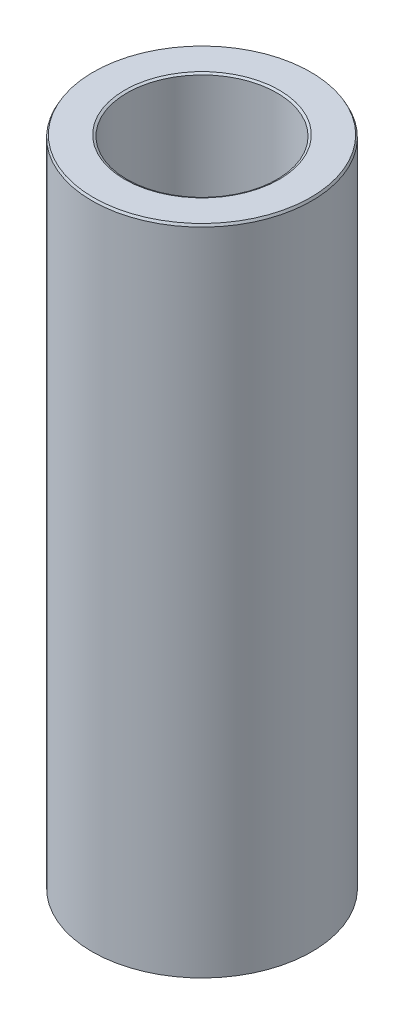
ISO-10303-21;
HEADER;
FILE_DESCRIPTION(('STEP AP214'),'2;1');
FILE_NAME('part.step','',(''),(''),'','','');
FILE_SCHEMA(('AUTOMOTIVE_DESIGN { 1 0 10303 214 1 1 1 1 }'));
ENDSEC;
DATA;
#1=APPLICATION_CONTEXT('core data for automotive mechanical design processes');
#2=APPLICATION_PROTOCOL_DEFINITION('international standard','automotive_design',2000,#1);
#3=PRODUCT_CONTEXT('',#1,'mechanical');
#4=PRODUCT('Part','Part','',(#3));
#5=PRODUCT_RELATED_PRODUCT_CATEGORY('part','',(#4));
#6=PRODUCT_DEFINITION_FORMATION('','',#4);
#7=PRODUCT_DEFINITION_CONTEXT('part definition',#1,'design');
#8=PRODUCT_DEFINITION('design','',#6,#7);
#9=PRODUCT_DEFINITION_SHAPE('','',#8);
#10=(LENGTH_UNIT() NAMED_UNIT(*) SI_UNIT(.MILLI.,.METRE.));
#11=(NAMED_UNIT(*) PLANE_ANGLE_UNIT() SI_UNIT($,.RADIAN.));
#12=(NAMED_UNIT(*) SI_UNIT($,.STERADIAN.) SOLID_ANGLE_UNIT());
#13=UNCERTAINTY_MEASURE_WITH_UNIT(LENGTH_MEASURE(1.E-05),#10,'distance_accuracy_value','');
#14=(GEOMETRIC_REPRESENTATION_CONTEXT(3) GLOBAL_UNCERTAINTY_ASSIGNED_CONTEXT((#13)) GLOBAL_UNIT_ASSIGNED_CONTEXT((#10,
#11,#12)) REPRESENTATION_CONTEXT('',''));
#15=CARTESIAN_POINT('',(0.,0.,0.));
#16=DIRECTION('',(0.,0.,1.));
#17=DIRECTION('',(1.,0.,0.));
#18=AXIS2_PLACEMENT_3D('',#15,#16,#17);
#19=CARTESIAN_POINT('',(0.,282.544344380291,0.));
#20=DIRECTION('',(0.,-1.,0.));
#21=DIRECTION('',(0.,0.,-1.));
#22=AXIS2_PLACEMENT_3D('',#19,#20,#21);
#23=CYLINDRICAL_SURFACE('',#22,47.5);
#24=CARTESIAN_POINT('',(0.,0.535694208257609,0.));
#25=DIRECTION('',(0.,1.,0.));
#26=DIRECTION('',(0.,0.,1.));
#27=AXIS2_PLACEMENT_3D('',#24,#25,#26);
#28=CIRCLE('',#27,47.5);
#29=CARTESIAN_POINT('',(0.,0.535694208257609,47.5));
#30=VERTEX_POINT('',#29);
#31=EDGE_CURVE('E10',#30,#30,#28,.T.);
#32=ORIENTED_EDGE('',*,*,#31,.T.);
#33=EDGE_LOOP('',(#32));
#34=FACE_BOUND('',#33,.T.);
#35=CARTESIAN_POINT('',(0.,281.544003636912,0.));
#36=DIRECTION('',(0.,1.,0.));
#37=DIRECTION('',(0.,0.,1.));
#38=AXIS2_PLACEMENT_3D('',#35,#36,#37);
#39=CIRCLE('',#38,47.5);
#40=CARTESIAN_POINT('',(0.,281.544003636912,47.5));
#41=VERTEX_POINT('',#40);
#42=EDGE_CURVE('E50',#41,#41,#39,.F.);
#43=ORIENTED_EDGE('',*,*,#42,.T.);
#44=EDGE_LOOP('',(#43));
#45=FACE_BOUND('',#44,.T.);
#46=ADVANCED_FACE('F39',(#34,#45),#23,.T.);
#47=CARTESIAN_POINT('',(0.,282.544344380291,0.));
#48=DIRECTION('',(0.,1.,0.));
#49=DIRECTION('',(0.,0.,1.));
#50=AXIS2_PLACEMENT_3D('',#47,#48,#49);
#51=PLANE('',#50);
#52=CARTESIAN_POINT('',(0.,282.544344380291,0.));
#53=DIRECTION('',(0.,1.,0.));
#54=DIRECTION('',(0.,0.,1.));
#55=AXIS2_PLACEMENT_3D('',#52,#53,#54);
#56=CIRCLE('',#55,33.4192161367255);
#57=CARTESIAN_POINT('',(0.,282.544344380291,33.4192161367255));
#58=VERTEX_POINT('',#57);
#59=EDGE_CURVE('E58',#58,#58,#56,.F.);
#60=ORIENTED_EDGE('',*,*,#59,.T.);
#61=EDGE_LOOP('',(#60));
#62=FACE_BOUND('',#61,.T.);
#63=CARTESIAN_POINT('',(0.,282.544344380291,0.));
#64=DIRECTION('',(0.,1.,0.));
#65=DIRECTION('',(0.,0.,1.));
#66=AXIS2_PLACEMENT_3D('',#63,#64,#65);
#67=CIRCLE('',#66,46.9643057917425);
#68=CARTESIAN_POINT('',(0.,282.544344380291,46.9643057917425));
#69=VERTEX_POINT('',#68);
#70=EDGE_CURVE('E61',#69,#69,#67,.T.);
#71=ORIENTED_EDGE('',*,*,#70,.T.);
#72=EDGE_LOOP('',(#71));
#73=FACE_BOUND('',#72,.T.);
#74=ADVANCED_FACE('F88',(#62,#73),#51,.T.);
#75=CARTESIAN_POINT('',(0.,0.,0.));
#76=DIRECTION('',(0.,1.,0.));
#77=DIRECTION('',(0.,0.,1.));
#78=AXIS2_PLACEMENT_3D('',#75,#76,#77);
#79=PLANE('',#78);
#80=CARTESIAN_POINT('',(0.,0.,0.));
#81=DIRECTION('',(0.,1.,0.));
#82=DIRECTION('',(0.,0.,1.));
#83=AXIS2_PLACEMENT_3D('',#80,#81,#82);
#84=CIRCLE('',#83,32.9545696016041);
#85=CARTESIAN_POINT('',(0.,0.,32.9545696016041));
#86=VERTEX_POINT('',#85);
#87=EDGE_CURVE('E51',#86,#86,#84,.T.);
#88=ORIENTED_EDGE('',*,*,#87,.T.);
#89=EDGE_LOOP('',(#88));
#90=FACE_BOUND('',#89,.T.);
#91=CARTESIAN_POINT('',(0.,0.,0.));
#92=DIRECTION('',(0.,1.,0.));
#93=DIRECTION('',(0.,0.,1.));
#94=AXIS2_PLACEMENT_3D('',#91,#92,#93);
#95=CIRCLE('',#94,46.499659256621);
#96=CARTESIAN_POINT('',(0.,0.,46.499659256621));
#97=VERTEX_POINT('',#96);
#98=EDGE_CURVE('E54',#97,#97,#95,.F.);
#99=ORIENTED_EDGE('',*,*,#98,.T.);
#100=EDGE_LOOP('',(#99));
#101=FACE_BOUND('',#100,.T.);
#102=ADVANCED_FACE('F83',(#90,#101),#79,.F.);
#103=CARTESIAN_POINT('',(0.,282.544344380291,0.));
#104=DIRECTION('',(0.,-1.,0.));
#105=DIRECTION('',(0.,0.,-1.));
#106=AXIS2_PLACEMENT_3D('',#103,#104,#105);
#107=CYLINDRICAL_SURFACE('',#106,32.4188753933465);
#108=CARTESIAN_POINT('',(0.,282.008650172034,0.));
#109=DIRECTION('',(0.,1.,0.));
#110=DIRECTION('',(0.,0.,1.));
#111=AXIS2_PLACEMENT_3D('',#108,#109,#110);
#112=CIRCLE('',#111,32.4188753933465);
#113=CARTESIAN_POINT('',(0.,282.008650172034,32.4188753933465));
#114=VERTEX_POINT('',#113);
#115=EDGE_CURVE('E67',#114,#114,#112,.T.);
#116=ORIENTED_EDGE('',*,*,#115,.T.);
#117=EDGE_LOOP('',(#116));
#118=FACE_BOUND('',#117,.T.);
#119=CARTESIAN_POINT('',(0.,1.00034074337901,0.));
#120=DIRECTION('',(0.,1.,0.));
#121=DIRECTION('',(0.,0.,1.));
#122=AXIS2_PLACEMENT_3D('',#119,#120,#121);
#123=CIRCLE('',#122,32.4188753933465);
#124=CARTESIAN_POINT('',(0.,1.00034074337901,32.4188753933465));
#125=VERTEX_POINT('',#124);
#126=EDGE_CURVE('E69',#125,#125,#123,.F.);
#127=ORIENTED_EDGE('',*,*,#126,.T.);
#128=EDGE_LOOP('',(#127));
#129=FACE_BOUND('',#128,.T.);
#130=ADVANCED_FACE('F71',(#118,#129),#107,.F.);
#131=CARTESIAN_POINT('',(0.,282.008650172034,0.));
#132=DIRECTION('',(0.,1.,0.));
#133=DIRECTION('',(0.,0.,1.));
#134=AXIS2_PLACEMENT_3D('',#131,#132,#133);
#135=CONICAL_SURFACE('',#134,32.4188753933465,1.07914454646921);
#136=ORIENTED_EDGE('',*,*,#59,.F.);
#137=EDGE_LOOP('',(#136));
#138=FACE_BOUND('',#137,.T.);
#139=ORIENTED_EDGE('',*,*,#115,.F.);
#140=EDGE_LOOP('',(#139));
#141=FACE_BOUND('',#140,.T.);
#142=ADVANCED_FACE('F77',(#138,#141),#135,.F.);
#143=CARTESIAN_POINT('',(0.,0.,0.));
#144=DIRECTION('',(0.,-1.,0.));
#145=DIRECTION('',(0.,0.,-1.));
#146=AXIS2_PLACEMENT_3D('',#143,#144,#145);
#147=CONICAL_SURFACE('',#146,32.9545696016041,0.491651780325639);
#148=ORIENTED_EDGE('',*,*,#126,.F.);
#149=EDGE_LOOP('',(#148));
#150=FACE_BOUND('',#149,.T.);
#151=ORIENTED_EDGE('',*,*,#87,.F.);
#152=EDGE_LOOP('',(#151));
#153=FACE_BOUND('',#152,.T.);
#154=ADVANCED_FACE('F73',(#150,#153),#147,.F.);
#155=CARTESIAN_POINT('',(0.,0.535694208257609,0.));
#156=DIRECTION('',(0.,1.,0.));
#157=DIRECTION('',(0.,0.,1.));
#158=AXIS2_PLACEMENT_3D('',#155,#156,#157);
#159=CONICAL_SURFACE('',#158,47.5,1.07914454646925);
#160=ORIENTED_EDGE('',*,*,#98,.F.);
#161=EDGE_LOOP('',(#160));
#162=FACE_BOUND('',#161,.T.);
#163=ORIENTED_EDGE('',*,*,#31,.F.);
#164=EDGE_LOOP('',(#163));
#165=FACE_BOUND('',#164,.T.);
#166=ADVANCED_FACE('F76',(#162,#165),#159,.T.);
#167=CARTESIAN_POINT('',(0.,282.544344380291,0.));
#168=DIRECTION('',(0.,-1.,0.));
#169=DIRECTION('',(0.,0.,-1.));
#170=AXIS2_PLACEMENT_3D('',#167,#168,#169);
#171=CONICAL_SURFACE('',#170,46.9643057917425,0.491651780325631);
#172=ORIENTED_EDGE('',*,*,#42,.F.);
#173=EDGE_LOOP('',(#172));
#174=FACE_BOUND('',#173,.T.);
#175=ORIENTED_EDGE('',*,*,#70,.F.);
#176=EDGE_LOOP('',(#175));
#177=FACE_BOUND('',#176,.T.);
#178=ADVANCED_FACE('F45',(#174,#177),#171,.T.);
#179=CLOSED_SHELL('',(#46,#74,#102,#130,#142,#154,#166,#178));
#180=MANIFOLD_SOLID_BREP('B2',#179);
#181=ADVANCED_BREP_SHAPE_REPRESENTATION('',(#18,#180),#14);
#182=SHAPE_DEFINITION_REPRESENTATION(#9,#181);
ENDSEC;
END-ISO-10303-21;
